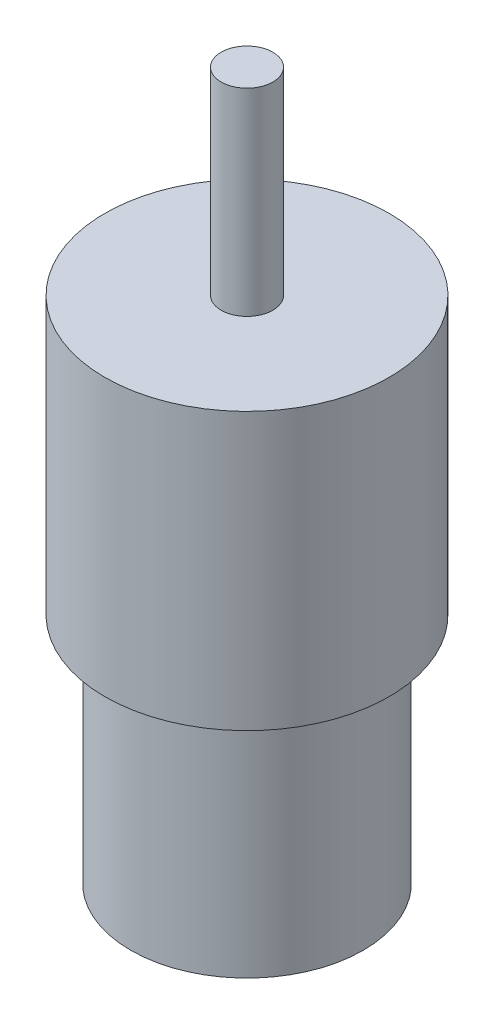
ISO-10303-21;
HEADER;
FILE_DESCRIPTION(('STEP AP214'),'2;1');
FILE_NAME('part.step','',(''),(''),'','','');
FILE_SCHEMA(('AUTOMOTIVE_DESIGN { 1 0 10303 214 1 1 1 1 }'));
ENDSEC;
DATA;
#1=APPLICATION_CONTEXT('core data for automotive mechanical design processes');
#2=APPLICATION_PROTOCOL_DEFINITION('international standard','automotive_design',2000,#1);
#3=PRODUCT_CONTEXT('',#1,'mechanical');
#4=PRODUCT('Part','Part','',(#3));
#5=PRODUCT_RELATED_PRODUCT_CATEGORY('part','',(#4));
#6=PRODUCT_DEFINITION_FORMATION('','',#4);
#7=PRODUCT_DEFINITION_CONTEXT('part definition',#1,'design');
#8=PRODUCT_DEFINITION('design','',#6,#7);
#9=PRODUCT_DEFINITION_SHAPE('','',#8);
#10=(LENGTH_UNIT() NAMED_UNIT(*) SI_UNIT(.MILLI.,.METRE.));
#11=(NAMED_UNIT(*) PLANE_ANGLE_UNIT() SI_UNIT($,.RADIAN.));
#12=(NAMED_UNIT(*) SI_UNIT($,.STERADIAN.) SOLID_ANGLE_UNIT());
#13=UNCERTAINTY_MEASURE_WITH_UNIT(LENGTH_MEASURE(1.E-05),#10,'distance_accuracy_value','');
#14=(GEOMETRIC_REPRESENTATION_CONTEXT(3) GLOBAL_UNCERTAINTY_ASSIGNED_CONTEXT((#13)) GLOBAL_UNIT_ASSIGNED_CONTEXT((#10,
#11,#12)) REPRESENTATION_CONTEXT('',''));
#15=CARTESIAN_POINT('',(0.,0.,0.));
#16=DIRECTION('',(0.,0.,1.));
#17=DIRECTION('',(1.,0.,0.));
#18=AXIS2_PLACEMENT_3D('',#15,#16,#17);
#19=CARTESIAN_POINT('',(0.,21.4,0.));
#20=DIRECTION('',(0.,-1.,0.));
#21=DIRECTION('',(0.,0.,-1.));
#22=AXIS2_PLACEMENT_3D('',#19,#20,#21);
#23=CYLINDRICAL_SURFACE('',#22,11.);
#24=CARTESIAN_POINT('',(0.,21.4,0.));
#25=DIRECTION('',(0.,1.,0.));
#26=DIRECTION('',(0.,0.,1.));
#27=AXIS2_PLACEMENT_3D('',#24,#25,#26);
#28=CIRCLE('',#27,11.);
#29=CARTESIAN_POINT('',(0.,21.4,11.));
#30=VERTEX_POINT('',#29);
#31=EDGE_CURVE('E52',#30,#30,#28,.T.);
#32=ORIENTED_EDGE('',*,*,#31,.F.);
#33=EDGE_LOOP('',(#32));
#34=FACE_BOUND('',#33,.T.);
#35=CARTESIAN_POINT('',(0.,0.,0.));
#36=DIRECTION('',(0.,1.,0.));
#37=DIRECTION('',(0.,0.,1.));
#38=AXIS2_PLACEMENT_3D('',#35,#36,#37);
#39=CIRCLE('',#38,11.);
#40=CARTESIAN_POINT('',(0.,0.,11.));
#41=VERTEX_POINT('',#40);
#42=EDGE_CURVE('E41',#41,#41,#39,.T.);
#43=ORIENTED_EDGE('',*,*,#42,.T.);
#44=EDGE_LOOP('',(#43));
#45=FACE_BOUND('',#44,.T.);
#46=ADVANCED_FACE('F38',(#34,#45),#23,.T.);
#47=CARTESIAN_POINT('',(0.,21.4,0.));
#48=DIRECTION('',(0.,1.,0.));
#49=DIRECTION('',(0.,0.,1.));
#50=AXIS2_PLACEMENT_3D('',#47,#48,#49);
#51=PLANE('',#50);
#52=CARTESIAN_POINT('',(0.,21.4,0.));
#53=DIRECTION('',(0.,1.,0.));
#54=DIRECTION('',(0.,0.,1.));
#55=AXIS2_PLACEMENT_3D('',#52,#53,#54);
#56=CIRCLE('',#55,2.);
#57=CARTESIAN_POINT('',(0.,21.4,2.));
#58=VERTEX_POINT('',#57);
#59=EDGE_CURVE('E46',#58,#58,#56,.T.);
#60=ORIENTED_EDGE('',*,*,#59,.F.);
#61=EDGE_LOOP('',(#60));
#62=FACE_BOUND('',#61,.T.);
#63=ORIENTED_EDGE('',*,*,#31,.T.);
#64=EDGE_LOOP('',(#63));
#65=FACE_BOUND('',#64,.T.);
#66=ADVANCED_FACE('F72',(#62,#65),#51,.T.);
#67=CARTESIAN_POINT('',(0.,0.,0.));
#68=DIRECTION('',(0.,1.,0.));
#69=DIRECTION('',(0.,0.,1.));
#70=AXIS2_PLACEMENT_3D('',#67,#68,#69);
#71=PLANE('',#70);
#72=CARTESIAN_POINT('',(0.,0.,0.));
#73=DIRECTION('',(0.,-1.,0.));
#74=DIRECTION('',(0.,0.,-1.));
#75=AXIS2_PLACEMENT_3D('',#72,#73,#74);
#76=CIRCLE('',#75,9.);
#77=CARTESIAN_POINT('',(0.,0.,-9.));
#78=VERTEX_POINT('',#77);
#79=EDGE_CURVE('E10',#78,#78,#76,.T.);
#80=ORIENTED_EDGE('',*,*,#79,.F.);
#81=EDGE_LOOP('',(#80));
#82=FACE_BOUND('',#81,.T.);
#83=ORIENTED_EDGE('',*,*,#42,.F.);
#84=EDGE_LOOP('',(#83));
#85=FACE_BOUND('',#84,.T.);
#86=ADVANCED_FACE('F69',(#82,#85),#71,.F.);
#87=CARTESIAN_POINT('',(0.,36.7,0.));
#88=DIRECTION('',(0.,-1.,0.));
#89=DIRECTION('',(0.,0.,-1.));
#90=AXIS2_PLACEMENT_3D('',#87,#88,#89);
#91=CYLINDRICAL_SURFACE('',#90,2.);
#92=CARTESIAN_POINT('',(0.,36.7,0.));
#93=DIRECTION('',(0.,1.,0.));
#94=DIRECTION('',(0.,0.,1.));
#95=AXIS2_PLACEMENT_3D('',#92,#93,#94);
#96=CIRCLE('',#95,2.);
#97=CARTESIAN_POINT('',(0.,36.7,2.));
#98=VERTEX_POINT('',#97);
#99=EDGE_CURVE('E57',#98,#98,#96,.T.);
#100=ORIENTED_EDGE('',*,*,#99,.F.);
#101=EDGE_LOOP('',(#100));
#102=FACE_BOUND('',#101,.T.);
#103=ORIENTED_EDGE('',*,*,#59,.T.);
#104=EDGE_LOOP('',(#103));
#105=FACE_BOUND('',#104,.T.);
#106=ADVANCED_FACE('F71',(#102,#105),#91,.T.);
#107=CARTESIAN_POINT('',(0.,36.7,0.));
#108=DIRECTION('',(0.,1.,0.));
#109=DIRECTION('',(0.,0.,1.));
#110=AXIS2_PLACEMENT_3D('',#107,#108,#109);
#111=PLANE('',#110);
#112=ORIENTED_EDGE('',*,*,#99,.T.);
#113=EDGE_LOOP('',(#112));
#114=FACE_BOUND('',#113,.T.);
#115=ADVANCED_FACE('F78',(#114),#111,.T.);
#116=CARTESIAN_POINT('',(0.,-18.,0.));
#117=DIRECTION('',(0.,1.,0.));
#118=DIRECTION('',(0.,0.,1.));
#119=AXIS2_PLACEMENT_3D('',#116,#117,#118);
#120=CYLINDRICAL_SURFACE('',#119,9.);
#121=CARTESIAN_POINT('',(0.,-18.,0.));
#122=DIRECTION('',(0.,-1.,0.));
#123=DIRECTION('',(0.,0.,-1.));
#124=AXIS2_PLACEMENT_3D('',#121,#122,#123);
#125=CIRCLE('',#124,9.);
#126=CARTESIAN_POINT('',(0.,-18.,-9.));
#127=VERTEX_POINT('',#126);
#128=EDGE_CURVE('E56',#127,#127,#125,.T.);
#129=ORIENTED_EDGE('',*,*,#128,.F.);
#130=EDGE_LOOP('',(#129));
#131=FACE_BOUND('',#130,.T.);
#132=ORIENTED_EDGE('',*,*,#79,.T.);
#133=EDGE_LOOP('',(#132));
#134=FACE_BOUND('',#133,.T.);
#135=ADVANCED_FACE('F108',(#131,#134),#120,.T.);
#136=CARTESIAN_POINT('',(0.,-18.,0.));
#137=DIRECTION('',(0.,-1.,0.));
#138=DIRECTION('',(0.,0.,-1.));
#139=AXIS2_PLACEMENT_3D('',#136,#137,#138);
#140=PLANE('',#139);
#141=ORIENTED_EDGE('',*,*,#128,.T.);
#142=EDGE_LOOP('',(#141));
#143=FACE_BOUND('',#142,.T.);
#144=ADVANCED_FACE('F122',(#143),#140,.T.);
#145=CLOSED_SHELL('',(#46,#66,#86,#106,#115,#135,#144));
#146=MANIFOLD_SOLID_BREP('B2',#145);
#147=ADVANCED_BREP_SHAPE_REPRESENTATION('',(#18,#146),#14);
#148=SHAPE_DEFINITION_REPRESENTATION(#9,#147);
ENDSEC;
END-ISO-10303-21;
